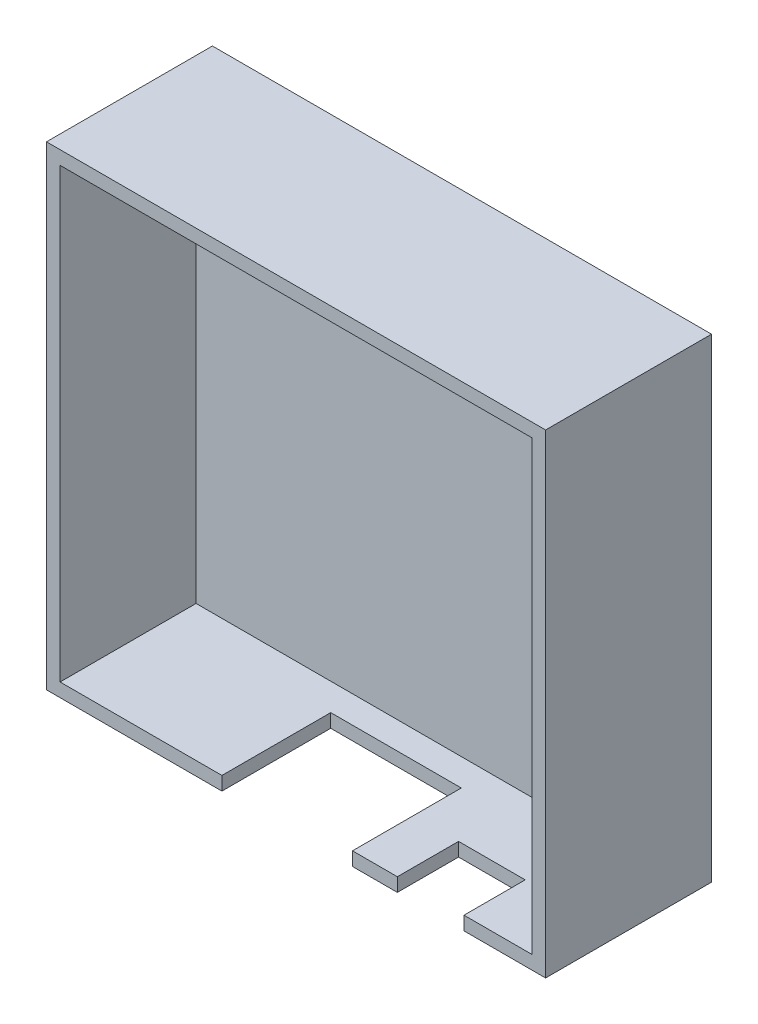
ISO-10303-21;
HEADER;
FILE_DESCRIPTION(('STEP AP214'),'2;1');
FILE_NAME('part.step','',(''),(''),'','','');
FILE_SCHEMA(('AUTOMOTIVE_DESIGN { 1 0 10303 214 1 1 1 1 }'));
ENDSEC;
DATA;
#1=APPLICATION_CONTEXT('core data for automotive mechanical design processes');
#2=APPLICATION_PROTOCOL_DEFINITION('international standard','automotive_design',2000,#1);
#3=PRODUCT_CONTEXT('',#1,'mechanical');
#4=PRODUCT('Part','Part','',(#3));
#5=PRODUCT_RELATED_PRODUCT_CATEGORY('part','',(#4));
#6=PRODUCT_DEFINITION_FORMATION('','',#4);
#7=PRODUCT_DEFINITION_CONTEXT('part definition',#1,'design');
#8=PRODUCT_DEFINITION('design','',#6,#7);
#9=PRODUCT_DEFINITION_SHAPE('','',#8);
#10=(LENGTH_UNIT() NAMED_UNIT(*) SI_UNIT(.MILLI.,.METRE.));
#11=(NAMED_UNIT(*) PLANE_ANGLE_UNIT() SI_UNIT($,.RADIAN.));
#12=(NAMED_UNIT(*) SI_UNIT($,.STERADIAN.) SOLID_ANGLE_UNIT());
#13=UNCERTAINTY_MEASURE_WITH_UNIT(LENGTH_MEASURE(1.E-05),#10,'distance_accuracy_value','');
#14=(GEOMETRIC_REPRESENTATION_CONTEXT(3) GLOBAL_UNCERTAINTY_ASSIGNED_CONTEXT((#13)) GLOBAL_UNIT_ASSIGNED_CONTEXT((#10,
#11,#12)) REPRESENTATION_CONTEXT('',''));
#15=CARTESIAN_POINT('',(0.,0.,0.));
#16=DIRECTION('',(0.,0.,1.));
#17=DIRECTION('',(1.,0.,0.));
#18=AXIS2_PLACEMENT_3D('',#15,#16,#17);
#19=CARTESIAN_POINT('',(1.,33.9,8.));
#20=DIRECTION('',(1.,0.,0.));
#21=DIRECTION('',(0.,1.,0.));
#22=AXIS2_PLACEMENT_3D('',#19,#20,#21);
#23=PLANE('',#22);
#24=DIRECTION('',(0.,0.,-1.));
#25=VECTOR('',#24,1.);
#26=CARTESIAN_POINT('',(1.,1.,8.));
#27=LINE('',#26,#25);
#28=CARTESIAN_POINT('',(1.,1.,8.));
#29=VERTEX_POINT('',#28);
#30=CARTESIAN_POINT('',(1.,1.,-2.));
#31=VERTEX_POINT('',#30);
#32=EDGE_CURVE('E159',#29,#31,#27,.T.);
#33=ORIENTED_EDGE('',*,*,#32,.T.);
#34=DIRECTION('',(0.,-1.,0.));
#35=VECTOR('',#34,1.);
#36=CARTESIAN_POINT('',(1.,1.,-2.));
#37=LINE('',#36,#35);
#38=CARTESIAN_POINT('',(1.,32.4,-2.));
#39=VERTEX_POINT('',#38);
#40=EDGE_CURVE('E162',#39,#31,#37,.T.);
#41=ORIENTED_EDGE('',*,*,#40,.F.);
#42=DIRECTION('',(0.,0.,-1.));
#43=VECTOR('',#42,1.);
#44=CARTESIAN_POINT('',(1.,32.4,1.6));
#45=LINE('',#44,#43);
#46=CARTESIAN_POINT('',(1.,32.4,1.6));
#47=VERTEX_POINT('',#46);
#48=EDGE_CURVE('E51',#47,#39,#45,.T.);
#49=ORIENTED_EDGE('',*,*,#48,.F.);
#50=DIRECTION('',(0.,-1.,0.));
#51=VECTOR('',#50,1.);
#52=CARTESIAN_POINT('',(1.,33.9,1.6));
#53=LINE('',#52,#51);
#54=CARTESIAN_POINT('',(1.,33.9,1.6));
#55=VERTEX_POINT('',#54);
#56=EDGE_CURVE('E196',#55,#47,#53,.T.);
#57=ORIENTED_EDGE('',*,*,#56,.F.);
#58=DIRECTION('',(0.,0.,-1.));
#59=VECTOR('',#58,1.);
#60=CARTESIAN_POINT('',(1.,33.9,8.));
#61=LINE('',#60,#59);
#62=CARTESIAN_POINT('',(1.,33.9,8.));
#63=VERTEX_POINT('',#62);
#64=EDGE_CURVE('E274',#63,#55,#61,.T.);
#65=ORIENTED_EDGE('',*,*,#64,.F.);
#66=DIRECTION('',(0.,-1.,0.));
#67=VECTOR('',#66,1.);
#68=CARTESIAN_POINT('',(1.,33.9,8.));
#69=LINE('',#68,#67);
#70=EDGE_CURVE('E166',#63,#29,#69,.T.);
#71=ORIENTED_EDGE('',*,*,#70,.T.);
#72=EDGE_LOOP('',(#33,#41,#49,#57,#65,#71));
#73=FACE_BOUND('',#72,.T.);
#74=ADVANCED_FACE('F36',(#73),#23,.T.);
#75=CARTESIAN_POINT('',(35.7,33.9,8.));
#76=DIRECTION('',(-1.,0.,0.));
#77=DIRECTION('',(0.,-1.,0.));
#78=AXIS2_PLACEMENT_3D('',#75,#76,#77);
#79=PLANE('',#78);
#80=DIRECTION('',(0.,1.,0.));
#81=VECTOR('',#80,1.);
#82=CARTESIAN_POINT('',(35.7,33.9,1.6));
#83=LINE('',#82,#81);
#84=CARTESIAN_POINT('',(35.7,32.4,1.6));
#85=VERTEX_POINT('',#84);
#86=CARTESIAN_POINT('',(35.7,33.9,1.6));
#87=VERTEX_POINT('',#86);
#88=EDGE_CURVE('E59',#85,#87,#83,.T.);
#89=ORIENTED_EDGE('',*,*,#88,.F.);
#90=DIRECTION('',(0.,0.,-1.));
#91=VECTOR('',#90,1.);
#92=CARTESIAN_POINT('',(35.7,32.4,1.6));
#93=LINE('',#92,#91);
#94=CARTESIAN_POINT('',(35.7,32.4,-2.));
#95=VERTEX_POINT('',#94);
#96=EDGE_CURVE('E200',#85,#95,#93,.T.);
#97=ORIENTED_EDGE('',*,*,#96,.T.);
#98=DIRECTION('',(0.,1.,0.));
#99=VECTOR('',#98,1.);
#100=CARTESIAN_POINT('',(35.7,1.,-2.));
#101=LINE('',#100,#99);
#102=CARTESIAN_POINT('',(35.7,1.,-2.));
#103=VERTEX_POINT('',#102);
#104=EDGE_CURVE('E181',#103,#95,#101,.T.);
#105=ORIENTED_EDGE('',*,*,#104,.F.);
#106=DIRECTION('',(0.,0.,-1.));
#107=VECTOR('',#106,1.);
#108=CARTESIAN_POINT('',(35.7,1.,8.));
#109=LINE('',#108,#107);
#110=CARTESIAN_POINT('',(35.7,1.,8.));
#111=VERTEX_POINT('',#110);
#112=EDGE_CURVE('E171',#111,#103,#109,.T.);
#113=ORIENTED_EDGE('',*,*,#112,.F.);
#114=DIRECTION('',(0.,1.,0.));
#115=VECTOR('',#114,1.);
#116=CARTESIAN_POINT('',(35.7,33.9,8.));
#117=LINE('',#116,#115);
#118=CARTESIAN_POINT('',(35.7,33.9,8.));
#119=VERTEX_POINT('',#118);
#120=EDGE_CURVE('E268',#111,#119,#117,.T.);
#121=ORIENTED_EDGE('',*,*,#120,.T.);
#122=DIRECTION('',(0.,0.,-1.));
#123=VECTOR('',#122,1.);
#124=CARTESIAN_POINT('',(35.7,33.9,8.));
#125=LINE('',#124,#123);
#126=EDGE_CURVE('E277',#119,#87,#125,.T.);
#127=ORIENTED_EDGE('',*,*,#126,.T.);
#128=EDGE_LOOP('',(#89,#97,#105,#113,#121,#127));
#129=FACE_BOUND('',#128,.T.);
#130=ADVANCED_FACE('F337',(#129),#79,.T.);
#131=CARTESIAN_POINT('',(1.,33.9,8.));
#132=DIRECTION('',(0.,-1.,0.));
#133=DIRECTION('',(0.,0.,-1.));
#134=AXIS2_PLACEMENT_3D('',#131,#132,#133);
#135=PLANE('',#134);
#136=ORIENTED_EDGE('',*,*,#64,.T.);
#137=DIRECTION('',(-1.,0.,0.));
#138=VECTOR('',#137,1.);
#139=CARTESIAN_POINT('',(35.7,33.9,1.6));
#140=LINE('',#139,#138);
#141=EDGE_CURVE('E193',#87,#55,#140,.T.);
#142=ORIENTED_EDGE('',*,*,#141,.F.);
#143=ORIENTED_EDGE('',*,*,#126,.F.);
#144=DIRECTION('',(-1.,0.,0.));
#145=VECTOR('',#144,1.);
#146=CARTESIAN_POINT('',(1.,33.9,8.));
#147=LINE('',#146,#145);
#148=EDGE_CURVE('E272',#119,#63,#147,.T.);
#149=ORIENTED_EDGE('',*,*,#148,.T.);
#150=EDGE_LOOP('',(#136,#142,#143,#149));
#151=FACE_BOUND('',#150,.T.);
#152=ADVANCED_FACE('F340',(#151),#135,.T.);
#153=CARTESIAN_POINT('',(0.,0.,0.));
#154=DIRECTION('',(0.,0.,-1.));
#155=DIRECTION('',(-1.,0.,0.));
#156=AXIS2_PLACEMENT_3D('',#153,#154,#155);
#157=PLANE('',#156);
#158=DIRECTION('',(0.,1.,0.));
#159=VECTOR('',#158,1.);
#160=CARTESIAN_POINT('',(22.5,0.,0.));
#161=LINE('',#160,#159);
#162=CARTESIAN_POINT('',(22.5,0.,0.));
#163=VERTEX_POINT('',#162);
#164=CARTESIAN_POINT('',(22.5,1.,0.));
#165=VERTEX_POINT('',#164);
#166=EDGE_CURVE('E208',#163,#165,#161,.T.);
#167=ORIENTED_EDGE('',*,*,#166,.T.);
#168=DIRECTION('',(1.,0.,0.));
#169=VECTOR('',#168,1.);
#170=CARTESIAN_POINT('',(1.,1.,0.));
#171=LINE('',#170,#169);
#172=CARTESIAN_POINT('',(12.9,1.,0.));
#173=VERTEX_POINT('',#172);
#174=EDGE_CURVE('E186',#173,#165,#171,.T.);
#175=ORIENTED_EDGE('',*,*,#174,.F.);
#176=DIRECTION('',(0.,-1.,0.));
#177=VECTOR('',#176,1.);
#178=CARTESIAN_POINT('',(12.9,0.,0.));
#179=LINE('',#178,#177);
#180=CARTESIAN_POINT('',(12.9,0.,0.));
#181=VERTEX_POINT('',#180);
#182=EDGE_CURVE('E217',#173,#181,#179,.T.);
#183=ORIENTED_EDGE('',*,*,#182,.T.);
#184=DIRECTION('',(1.,0.,0.));
#185=VECTOR('',#184,1.);
#186=CARTESIAN_POINT('',(22.5,0.,0.));
#187=LINE('',#186,#185);
#188=EDGE_CURVE('E213',#181,#163,#187,.T.);
#189=ORIENTED_EDGE('',*,*,#188,.T.);
#190=EDGE_LOOP('',(#167,#175,#183,#189));
#191=FACE_BOUND('',#190,.T.);
#192=ADVANCED_FACE('F389',(#191),#157,.F.);
#193=CARTESIAN_POINT('',(0.,0.,8.));
#194=DIRECTION('',(0.,0.,-1.));
#195=DIRECTION('',(-1.,0.,0.));
#196=AXIS2_PLACEMENT_3D('',#193,#194,#195);
#197=PLANE('',#196);
#198=DIRECTION('',(1.,0.,0.));
#199=VECTOR('',#198,1.);
#200=CARTESIAN_POINT('',(0.,0.,8.));
#201=LINE('',#200,#199);
#202=CARTESIAN_POINT('',(0.,0.,8.));
#203=VERTEX_POINT('',#202);
#204=CARTESIAN_POINT('',(12.9,0.,8.));
#205=VERTEX_POINT('',#204);
#206=EDGE_CURVE('E283',#203,#205,#201,.T.);
#207=ORIENTED_EDGE('',*,*,#206,.T.);
#208=DIRECTION('',(0.,-1.,0.));
#209=VECTOR('',#208,1.);
#210=CARTESIAN_POINT('',(12.9,0.,8.));
#211=LINE('',#210,#209);
#212=CARTESIAN_POINT('',(12.9,1.,8.));
#213=VERTEX_POINT('',#212);
#214=EDGE_CURVE('E204',#213,#205,#211,.T.);
#215=ORIENTED_EDGE('',*,*,#214,.F.);
#216=DIRECTION('',(1.,0.,0.));
#217=VECTOR('',#216,1.);
#218=CARTESIAN_POINT('',(1.,1.,8.));
#219=LINE('',#218,#217);
#220=EDGE_CURVE('E266',#29,#213,#219,.T.);
#221=ORIENTED_EDGE('',*,*,#220,.F.);
#222=ORIENTED_EDGE('',*,*,#70,.F.);
#223=ORIENTED_EDGE('',*,*,#148,.F.);
#224=ORIENTED_EDGE('',*,*,#120,.F.);
#225=CARTESIAN_POINT('',(30.7,1.,8.));
#226=VERTEX_POINT('',#225);
#227=EDGE_CURVE('E265',#226,#111,#219,.T.);
#228=ORIENTED_EDGE('',*,*,#227,.F.);
#229=DIRECTION('',(0.,1.,0.));
#230=VECTOR('',#229,1.);
#231=CARTESIAN_POINT('',(30.7,0.,8.));
#232=LINE('',#231,#230);
#233=CARTESIAN_POINT('',(30.7,0.,8.));
#234=VERTEX_POINT('',#233);
#235=EDGE_CURVE('E225',#234,#226,#232,.T.);
#236=ORIENTED_EDGE('',*,*,#235,.F.);
#237=CARTESIAN_POINT('',(36.7,0.,8.));
#238=VERTEX_POINT('',#237);
#239=EDGE_CURVE('E282',#234,#238,#201,.T.);
#240=ORIENTED_EDGE('',*,*,#239,.T.);
#241=DIRECTION('',(0.,1.,0.));
#242=VECTOR('',#241,1.);
#243=CARTESIAN_POINT('',(36.7,0.,8.));
#244=LINE('',#243,#242);
#245=CARTESIAN_POINT('',(36.7,34.9,8.));
#246=VERTEX_POINT('',#245);
#247=EDGE_CURVE('E286',#238,#246,#244,.T.);
#248=ORIENTED_EDGE('',*,*,#247,.T.);
#249=DIRECTION('',(-1.,0.,0.));
#250=VECTOR('',#249,1.);
#251=CARTESIAN_POINT('',(0.,34.9,8.));
#252=LINE('',#251,#250);
#253=CARTESIAN_POINT('',(0.,34.9,8.));
#254=VERTEX_POINT('',#253);
#255=EDGE_CURVE('E289',#246,#254,#252,.T.);
#256=ORIENTED_EDGE('',*,*,#255,.T.);
#257=DIRECTION('',(0.,-1.,0.));
#258=VECTOR('',#257,1.);
#259=CARTESIAN_POINT('',(0.,0.,8.));
#260=LINE('',#259,#258);
#261=EDGE_CURVE('E170',#254,#203,#260,.T.);
#262=ORIENTED_EDGE('',*,*,#261,.T.);
#263=EDGE_LOOP('',(#207,#215,#221,#222,#223,#224,#228,#236,#240,#248,#256,#262));
#264=FACE_BOUND('',#263,.T.);
#265=ADVANCED_FACE('F316',(#264),#197,.F.);
#266=CARTESIAN_POINT('',(22.5,1.,8.));
#267=VERTEX_POINT('',#266);
#268=CARTESIAN_POINT('',(25.8,1.,8.));
#269=VERTEX_POINT('',#268);
#270=EDGE_CURVE('E269',#267,#269,#219,.T.);
#271=ORIENTED_EDGE('',*,*,#270,.F.);
#272=DIRECTION('',(0.,1.,0.));
#273=VECTOR('',#272,1.);
#274=CARTESIAN_POINT('',(22.5,0.,8.));
#275=LINE('',#274,#273);
#276=CARTESIAN_POINT('',(22.5,0.,8.));
#277=VERTEX_POINT('',#276);
#278=EDGE_CURVE('E203',#277,#267,#275,.T.);
#279=ORIENTED_EDGE('',*,*,#278,.F.);
#280=CARTESIAN_POINT('',(25.8,0.,8.));
#281=VERTEX_POINT('',#280);
#282=EDGE_CURVE('E287',#277,#281,#201,.T.);
#283=ORIENTED_EDGE('',*,*,#282,.T.);
#284=DIRECTION('',(0.,-1.,0.));
#285=VECTOR('',#284,1.);
#286=CARTESIAN_POINT('',(25.8,0.,8.));
#287=LINE('',#286,#285);
#288=EDGE_CURVE('E226',#269,#281,#287,.T.);
#289=ORIENTED_EDGE('',*,*,#288,.F.);
#290=EDGE_LOOP('',(#271,#279,#283,#289));
#291=FACE_BOUND('',#290,.T.);
#292=ADVANCED_FACE('F325',(#291),#197,.F.);
#293=CARTESIAN_POINT('',(0.,0.,8.));
#294=DIRECTION('',(1.,0.,0.));
#295=DIRECTION('',(0.,1.,0.));
#296=AXIS2_PLACEMENT_3D('',#293,#294,#295);
#297=PLANE('',#296);
#298=DIRECTION('',(0.,0.,-1.));
#299=VECTOR('',#298,1.);
#300=CARTESIAN_POINT('',(0.,34.9,8.));
#301=LINE('',#300,#299);
#302=CARTESIAN_POINT('',(0.,34.9,-4.2));
#303=VERTEX_POINT('',#302);
#304=EDGE_CURVE('E291',#254,#303,#301,.T.);
#305=ORIENTED_EDGE('',*,*,#304,.T.);
#306=DIRECTION('',(0.,1.,0.));
#307=VECTOR('',#306,1.);
#308=CARTESIAN_POINT('',(0.,34.9,-4.2));
#309=LINE('',#308,#307);
#310=CARTESIAN_POINT('',(0.,0.,-4.2));
#311=VERTEX_POINT('',#310);
#312=EDGE_CURVE('E258',#311,#303,#309,.T.);
#313=ORIENTED_EDGE('',*,*,#312,.F.);
#314=DIRECTION('',(0.,0.,-1.));
#315=VECTOR('',#314,1.);
#316=CARTESIAN_POINT('',(0.,0.,8.));
#317=LINE('',#316,#315);
#318=EDGE_CURVE('E13',#203,#311,#317,.T.);
#319=ORIENTED_EDGE('',*,*,#318,.F.);
#320=ORIENTED_EDGE('',*,*,#261,.F.);
#321=EDGE_LOOP('',(#305,#313,#319,#320));
#322=FACE_BOUND('',#321,.T.);
#323=ADVANCED_FACE('F38',(#322),#297,.F.);
#324=CARTESIAN_POINT('',(0.,0.,8.));
#325=DIRECTION('',(0.,1.,0.));
#326=DIRECTION('',(0.,0.,1.));
#327=AXIS2_PLACEMENT_3D('',#324,#325,#326);
#328=PLANE('',#327);
#329=ORIENTED_EDGE('',*,*,#188,.F.);
#330=DIRECTION('',(0.,0.,1.));
#331=VECTOR('',#330,1.);
#332=CARTESIAN_POINT('',(12.9,0.,-9.65194280961092));
#333=LINE('',#332,#331);
#334=EDGE_CURVE('E216',#181,#205,#333,.T.);
#335=ORIENTED_EDGE('',*,*,#334,.T.);
#336=ORIENTED_EDGE('',*,*,#206,.F.);
#337=ORIENTED_EDGE('',*,*,#318,.T.);
#338=DIRECTION('',(-1.,0.,0.));
#339=VECTOR('',#338,1.);
#340=CARTESIAN_POINT('',(36.7,0.,-4.2));
#341=LINE('',#340,#339);
#342=CARTESIAN_POINT('',(36.7,0.,-4.2));
#343=VERTEX_POINT('',#342);
#344=EDGE_CURVE('E255',#343,#311,#341,.T.);
#345=ORIENTED_EDGE('',*,*,#344,.F.);
#346=DIRECTION('',(0.,0.,-1.));
#347=VECTOR('',#346,1.);
#348=CARTESIAN_POINT('',(36.7,0.,8.));
#349=LINE('',#348,#347);
#350=EDGE_CURVE('E44',#238,#343,#349,.T.);
#351=ORIENTED_EDGE('',*,*,#350,.F.);
#352=ORIENTED_EDGE('',*,*,#239,.F.);
#353=DIRECTION('',(0.,0.,1.));
#354=VECTOR('',#353,1.);
#355=CARTESIAN_POINT('',(30.7,0.,-5.00099990002));
#356=LINE('',#355,#354);
#357=CARTESIAN_POINT('',(30.7,0.,3.5));
#358=VERTEX_POINT('',#357);
#359=EDGE_CURVE('E237',#358,#234,#356,.T.);
#360=ORIENTED_EDGE('',*,*,#359,.F.);
#361=DIRECTION('',(1.,0.,0.));
#362=VECTOR('',#361,1.);
#363=CARTESIAN_POINT('',(30.7,0.,3.5));
#364=LINE('',#363,#362);
#365=CARTESIAN_POINT('',(25.8,0.,3.5));
#366=VERTEX_POINT('',#365);
#367=EDGE_CURVE('E238',#366,#358,#364,.T.);
#368=ORIENTED_EDGE('',*,*,#367,.F.);
#369=DIRECTION('',(0.,0.,1.));
#370=VECTOR('',#369,1.);
#371=CARTESIAN_POINT('',(25.8,0.,-5.00099990002));
#372=LINE('',#371,#370);
#373=EDGE_CURVE('E241',#366,#281,#372,.T.);
#374=ORIENTED_EDGE('',*,*,#373,.T.);
#375=ORIENTED_EDGE('',*,*,#282,.F.);
#376=DIRECTION('',(0.,0.,1.));
#377=VECTOR('',#376,1.);
#378=CARTESIAN_POINT('',(22.5,0.,-9.65194280961092));
#379=LINE('',#378,#377);
#380=EDGE_CURVE('E212',#163,#277,#379,.T.);
#381=ORIENTED_EDGE('',*,*,#380,.F.);
#382=EDGE_LOOP('',(#329,#335,#336,#337,#345,#351,#352,#360,#368,#374,#375,#381));
#383=FACE_BOUND('',#382,.T.);
#384=ADVANCED_FACE('F304',(#383),#328,.F.);
#385=CARTESIAN_POINT('',(36.7,0.,8.));
#386=DIRECTION('',(-1.,0.,0.));
#387=DIRECTION('',(0.,0.,1.));
#388=AXIS2_PLACEMENT_3D('',#385,#386,#387);
#389=PLANE('',#388);
#390=ORIENTED_EDGE('',*,*,#350,.T.);
#391=DIRECTION('',(0.,-1.,0.));
#392=VECTOR('',#391,1.);
#393=CARTESIAN_POINT('',(36.7,34.9,-4.2));
#394=LINE('',#393,#392);
#395=CARTESIAN_POINT('',(36.7,34.9,-4.2));
#396=VERTEX_POINT('',#395);
#397=EDGE_CURVE('E252',#396,#343,#394,.T.);
#398=ORIENTED_EDGE('',*,*,#397,.F.);
#399=DIRECTION('',(0.,0.,-1.));
#400=VECTOR('',#399,1.);
#401=CARTESIAN_POINT('',(36.7,34.9,8.));
#402=LINE('',#401,#400);
#403=EDGE_CURVE('E293',#246,#396,#402,.T.);
#404=ORIENTED_EDGE('',*,*,#403,.F.);
#405=ORIENTED_EDGE('',*,*,#247,.F.);
#406=EDGE_LOOP('',(#390,#398,#404,#405));
#407=FACE_BOUND('',#406,.T.);
#408=ADVANCED_FACE('F299',(#407),#389,.F.);
#409=CARTESIAN_POINT('',(0.,34.9,8.));
#410=DIRECTION('',(0.,-1.,0.));
#411=DIRECTION('',(0.,0.,-1.));
#412=AXIS2_PLACEMENT_3D('',#409,#410,#411);
#413=PLANE('',#412);
#414=ORIENTED_EDGE('',*,*,#403,.T.);
#415=DIRECTION('',(1.,0.,0.));
#416=VECTOR('',#415,1.);
#417=CARTESIAN_POINT('',(36.7,34.9,-4.2));
#418=LINE('',#417,#416);
#419=EDGE_CURVE('E261',#303,#396,#418,.T.);
#420=ORIENTED_EDGE('',*,*,#419,.F.);
#421=ORIENTED_EDGE('',*,*,#304,.F.);
#422=ORIENTED_EDGE('',*,*,#255,.F.);
#423=EDGE_LOOP('',(#414,#420,#421,#422));
#424=FACE_BOUND('',#423,.T.);
#425=ADVANCED_FACE('F312',(#424),#413,.F.);
#426=CARTESIAN_POINT('',(1.,1.,8.));
#427=DIRECTION('',(0.,1.,0.));
#428=DIRECTION('',(0.,0.,1.));
#429=AXIS2_PLACEMENT_3D('',#426,#427,#428);
#430=PLANE('',#429);
#431=DIRECTION('',(0.,0.,1.));
#432=VECTOR('',#431,1.);
#433=CARTESIAN_POINT('',(22.5,1.,-9.65194280961092));
#434=LINE('',#433,#432);
#435=EDGE_CURVE('E211',#165,#267,#434,.T.);
#436=ORIENTED_EDGE('',*,*,#435,.T.);
#437=ORIENTED_EDGE('',*,*,#270,.T.);
#438=DIRECTION('',(0.,0.,1.));
#439=VECTOR('',#438,1.);
#440=CARTESIAN_POINT('',(25.8,1.,-5.00099990002));
#441=LINE('',#440,#439);
#442=CARTESIAN_POINT('',(25.8,1.,3.5));
#443=VERTEX_POINT('',#442);
#444=EDGE_CURVE('E233',#443,#269,#441,.T.);
#445=ORIENTED_EDGE('',*,*,#444,.F.);
#446=DIRECTION('',(-1.,0.,0.));
#447=VECTOR('',#446,1.);
#448=CARTESIAN_POINT('',(30.7,1.,3.5));
#449=LINE('',#448,#447);
#450=CARTESIAN_POINT('',(30.7,1.,3.5));
#451=VERTEX_POINT('',#450);
#452=EDGE_CURVE('E229',#451,#443,#449,.T.);
#453=ORIENTED_EDGE('',*,*,#452,.F.);
#454=DIRECTION('',(0.,0.,1.));
#455=VECTOR('',#454,1.);
#456=CARTESIAN_POINT('',(30.7,1.,-5.00099990002));
#457=LINE('',#456,#455);
#458=EDGE_CURVE('E236',#451,#226,#457,.T.);
#459=ORIENTED_EDGE('',*,*,#458,.T.);
#460=ORIENTED_EDGE('',*,*,#227,.T.);
#461=ORIENTED_EDGE('',*,*,#112,.T.);
#462=DIRECTION('',(1.,0.,0.));
#463=VECTOR('',#462,1.);
#464=CARTESIAN_POINT('',(1.,1.,-2.));
#465=LINE('',#464,#463);
#466=EDGE_CURVE('E174',#31,#103,#465,.T.);
#467=ORIENTED_EDGE('',*,*,#466,.F.);
#468=ORIENTED_EDGE('',*,*,#32,.F.);
#469=ORIENTED_EDGE('',*,*,#220,.T.);
#470=DIRECTION('',(0.,0.,1.));
#471=VECTOR('',#470,1.);
#472=CARTESIAN_POINT('',(12.9,1.,-9.65194280961092));
#473=LINE('',#472,#471);
#474=EDGE_CURVE('E206',#173,#213,#473,.T.);
#475=ORIENTED_EDGE('',*,*,#474,.F.);
#476=ORIENTED_EDGE('',*,*,#174,.T.);
#477=EDGE_LOOP('',(#436,#437,#445,#453,#459,#460,#461,#467,#468,#469,#475,#476));
#478=FACE_BOUND('',#477,.T.);
#479=ADVANCED_FACE('F176',(#478),#430,.T.);
#480=CARTESIAN_POINT('',(0.,0.,-4.2));
#481=DIRECTION('',(0.,0.,-1.));
#482=DIRECTION('',(-1.,0.,0.));
#483=AXIS2_PLACEMENT_3D('',#480,#481,#482);
#484=PLANE('',#483);
#485=ORIENTED_EDGE('',*,*,#397,.T.);
#486=ORIENTED_EDGE('',*,*,#344,.T.);
#487=ORIENTED_EDGE('',*,*,#312,.T.);
#488=ORIENTED_EDGE('',*,*,#419,.T.);
#489=EDGE_LOOP('',(#485,#486,#487,#488));
#490=FACE_BOUND('',#489,.T.);
#491=ADVANCED_FACE('F308',(#490),#484,.T.);
#492=CARTESIAN_POINT('',(0.,0.,3.5));
#493=DIRECTION('',(0.,0.,-1.));
#494=DIRECTION('',(-1.,0.,0.));
#495=AXIS2_PLACEMENT_3D('',#492,#493,#494);
#496=PLANE('',#495);
#497=DIRECTION('',(0.,1.,0.));
#498=VECTOR('',#497,1.);
#499=CARTESIAN_POINT('',(30.7,0.,3.5));
#500=LINE('',#499,#498);
#501=EDGE_CURVE('E234',#358,#451,#500,.T.);
#502=ORIENTED_EDGE('',*,*,#501,.T.);
#503=ORIENTED_EDGE('',*,*,#452,.T.);
#504=DIRECTION('',(0.,-1.,0.));
#505=VECTOR('',#504,1.);
#506=CARTESIAN_POINT('',(25.8,0.,3.5));
#507=LINE('',#506,#505);
#508=EDGE_CURVE('E242',#443,#366,#507,.T.);
#509=ORIENTED_EDGE('',*,*,#508,.T.);
#510=ORIENTED_EDGE('',*,*,#367,.T.);
#511=EDGE_LOOP('',(#502,#503,#509,#510));
#512=FACE_BOUND('',#511,.T.);
#513=ADVANCED_FACE('F332',(#512),#496,.F.);
#514=CARTESIAN_POINT('',(25.8,0.,-5.00099990002));
#515=DIRECTION('',(-1.,0.,0.));
#516=DIRECTION('',(0.,0.,1.));
#517=AXIS2_PLACEMENT_3D('',#514,#515,#516);
#518=PLANE('',#517);
#519=ORIENTED_EDGE('',*,*,#444,.T.);
#520=ORIENTED_EDGE('',*,*,#288,.T.);
#521=ORIENTED_EDGE('',*,*,#373,.F.);
#522=ORIENTED_EDGE('',*,*,#508,.F.);
#523=EDGE_LOOP('',(#519,#520,#521,#522));
#524=FACE_BOUND('',#523,.T.);
#525=ADVANCED_FACE('F328',(#524),#518,.F.);
#526=CARTESIAN_POINT('',(30.7,0.,-5.00099990002));
#527=DIRECTION('',(1.,0.,0.));
#528=DIRECTION('',(0.,0.,-1.));
#529=AXIS2_PLACEMENT_3D('',#526,#527,#528);
#530=PLANE('',#529);
#531=ORIENTED_EDGE('',*,*,#359,.T.);
#532=ORIENTED_EDGE('',*,*,#235,.T.);
#533=ORIENTED_EDGE('',*,*,#458,.F.);
#534=ORIENTED_EDGE('',*,*,#501,.F.);
#535=EDGE_LOOP('',(#531,#532,#533,#534));
#536=FACE_BOUND('',#535,.T.);
#537=ADVANCED_FACE('F449',(#536),#530,.F.);
#538=CARTESIAN_POINT('',(12.9,0.,-9.65194280961092));
#539=DIRECTION('',(-1.,0.,0.));
#540=DIRECTION('',(0.,-1.,0.));
#541=AXIS2_PLACEMENT_3D('',#538,#539,#540);
#542=PLANE('',#541);
#543=ORIENTED_EDGE('',*,*,#474,.T.);
#544=ORIENTED_EDGE('',*,*,#214,.T.);
#545=ORIENTED_EDGE('',*,*,#334,.F.);
#546=ORIENTED_EDGE('',*,*,#182,.F.);
#547=EDGE_LOOP('',(#543,#544,#545,#546));
#548=FACE_BOUND('',#547,.T.);
#549=ADVANCED_FACE('F355',(#548),#542,.F.);
#550=CARTESIAN_POINT('',(22.5,0.,-9.65194280961092));
#551=DIRECTION('',(1.,0.,0.));
#552=DIRECTION('',(0.,0.,-1.));
#553=AXIS2_PLACEMENT_3D('',#550,#551,#552);
#554=PLANE('',#553);
#555=ORIENTED_EDGE('',*,*,#380,.T.);
#556=ORIENTED_EDGE('',*,*,#278,.T.);
#557=ORIENTED_EDGE('',*,*,#435,.F.);
#558=ORIENTED_EDGE('',*,*,#166,.F.);
#559=EDGE_LOOP('',(#555,#556,#557,#558));
#560=FACE_BOUND('',#559,.T.);
#561=ADVANCED_FACE('F348',(#560),#554,.F.);
#562=CARTESIAN_POINT('',(35.7,32.4,1.6));
#563=DIRECTION('',(0.,1.,0.));
#564=DIRECTION('',(-1.,0.,0.));
#565=AXIS2_PLACEMENT_3D('',#562,#563,#564);
#566=PLANE('',#565);
#567=ORIENTED_EDGE('',*,*,#48,.T.);
#568=DIRECTION('',(-1.,0.,0.));
#569=VECTOR('',#568,1.);
#570=CARTESIAN_POINT('',(1.,32.4,-2.));
#571=LINE('',#570,#569);
#572=EDGE_CURVE('E185',#95,#39,#571,.T.);
#573=ORIENTED_EDGE('',*,*,#572,.F.);
#574=ORIENTED_EDGE('',*,*,#96,.F.);
#575=DIRECTION('',(1.,0.,0.));
#576=VECTOR('',#575,1.);
#577=CARTESIAN_POINT('',(35.7,32.4,1.6));
#578=LINE('',#577,#576);
#579=EDGE_CURVE('E198',#47,#85,#578,.T.);
#580=ORIENTED_EDGE('',*,*,#579,.F.);
#581=EDGE_LOOP('',(#567,#573,#574,#580));
#582=FACE_BOUND('',#581,.T.);
#583=ADVANCED_FACE('F346',(#582),#566,.F.);
#584=CARTESIAN_POINT('',(0.,0.,1.6));
#585=DIRECTION('',(0.,0.,-1.));
#586=DIRECTION('',(-1.,0.,0.));
#587=AXIS2_PLACEMENT_3D('',#584,#585,#586);
#588=PLANE('',#587);
#589=ORIENTED_EDGE('',*,*,#88,.T.);
#590=ORIENTED_EDGE('',*,*,#141,.T.);
#591=ORIENTED_EDGE('',*,*,#56,.T.);
#592=ORIENTED_EDGE('',*,*,#579,.T.);
#593=EDGE_LOOP('',(#589,#590,#591,#592));
#594=FACE_BOUND('',#593,.T.);
#595=ADVANCED_FACE('F343',(#594),#588,.F.);
#596=CARTESIAN_POINT('',(0.,0.,-2.));
#597=DIRECTION('',(0.,0.,-1.));
#598=DIRECTION('',(-1.,0.,0.));
#599=AXIS2_PLACEMENT_3D('',#596,#597,#598);
#600=PLANE('',#599);
#601=ORIENTED_EDGE('',*,*,#40,.T.);
#602=ORIENTED_EDGE('',*,*,#466,.T.);
#603=ORIENTED_EDGE('',*,*,#104,.T.);
#604=ORIENTED_EDGE('',*,*,#572,.T.);
#605=EDGE_LOOP('',(#601,#602,#603,#604));
#606=FACE_BOUND('',#605,.T.);
#607=ADVANCED_FACE('F183',(#606),#600,.F.);
#608=CLOSED_SHELL('',(#74,#130,#152,#192,#265,#292,#323,#384,#408,#425,#479,#491,#513,#525,#537,
#549,#561,#583,#595,#607));
#609=MANIFOLD_SOLID_BREP('B2',#608);
#610=ADVANCED_BREP_SHAPE_REPRESENTATION('',(#18,#609),#14);
#611=SHAPE_DEFINITION_REPRESENTATION(#9,#610);
ENDSEC;
END-ISO-10303-21;
